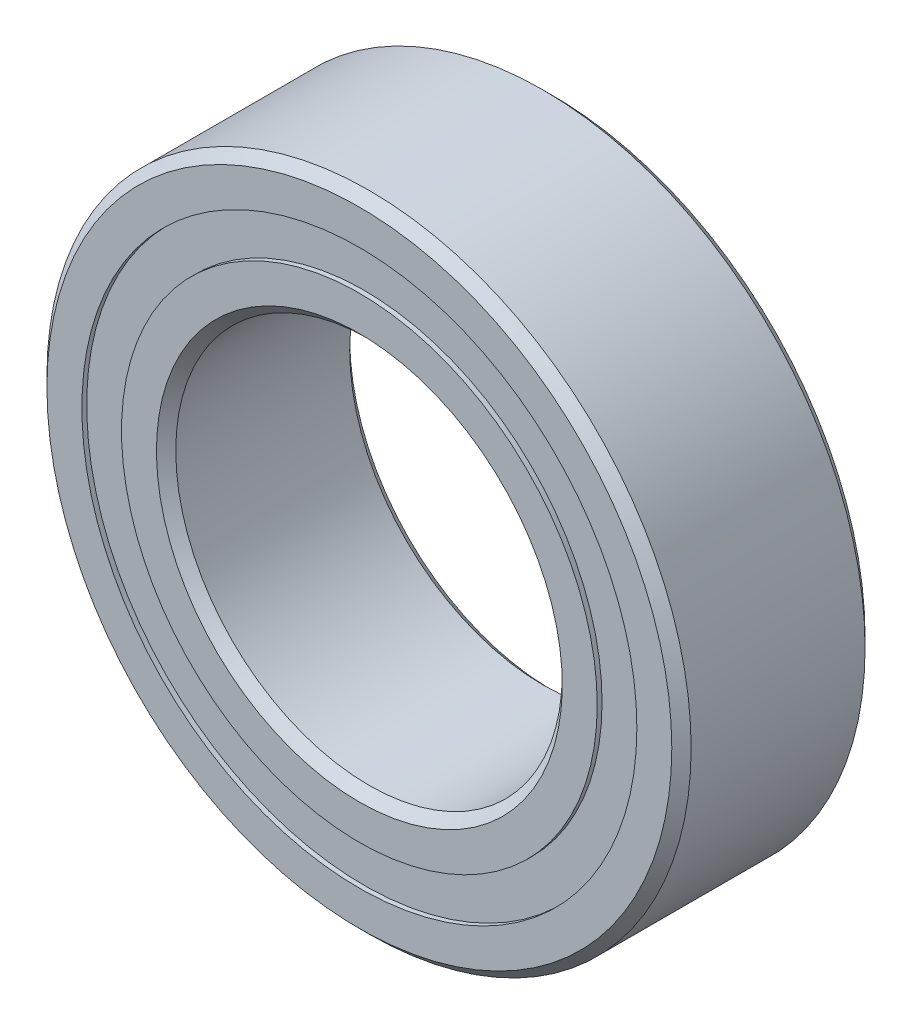
ISO-10303-21;
HEADER;
FILE_DESCRIPTION(('STEP AP214'),'2;1');
FILE_NAME('part.step','',(''),(''),'','','');
FILE_SCHEMA(('AUTOMOTIVE_DESIGN { 1 0 10303 214 1 1 1 1 }'));
ENDSEC;
DATA;
#1=APPLICATION_CONTEXT('core data for automotive mechanical design processes');
#2=APPLICATION_PROTOCOL_DEFINITION('international standard','automotive_design',2000,#1);
#3=PRODUCT_CONTEXT('',#1,'mechanical');
#4=PRODUCT('Part','Part','',(#3));
#5=PRODUCT_RELATED_PRODUCT_CATEGORY('part','',(#4));
#6=PRODUCT_DEFINITION_FORMATION('','',#4);
#7=PRODUCT_DEFINITION_CONTEXT('part definition',#1,'design');
#8=PRODUCT_DEFINITION('design','',#6,#7);
#9=PRODUCT_DEFINITION_SHAPE('','',#8);
#10=(LENGTH_UNIT() NAMED_UNIT(*) SI_UNIT(.MILLI.,.METRE.));
#11=(NAMED_UNIT(*) PLANE_ANGLE_UNIT() SI_UNIT($,.RADIAN.));
#12=(NAMED_UNIT(*) SI_UNIT($,.STERADIAN.) SOLID_ANGLE_UNIT());
#13=UNCERTAINTY_MEASURE_WITH_UNIT(LENGTH_MEASURE(1.E-05),#10,'distance_accuracy_value','');
#14=(GEOMETRIC_REPRESENTATION_CONTEXT(3) GLOBAL_UNCERTAINTY_ASSIGNED_CONTEXT((#13)) GLOBAL_UNIT_ASSIGNED_CONTEXT((#10,
#11,#12)) REPRESENTATION_CONTEXT('',''));
#15=CARTESIAN_POINT('',(0.,0.,0.));
#16=DIRECTION('',(0.,0.,1.));
#17=DIRECTION('',(1.,0.,0.));
#18=AXIS2_PLACEMENT_3D('',#15,#16,#17);
#19=CARTESIAN_POINT('',(3.46410161513775,-2.00000000000002,0.));
#20=DIRECTION('',(0.866025403784436,-0.500000000000004,0.));
#21=DIRECTION('',(0.,0.,-1.));
#22=AXIS2_PLACEMENT_3D('',#19,#20,#21);
#23=SPHERICAL_SURFACE('',#22,0.734247234014171);
#24=CARTESIAN_POINT('',(4.09997837245248,-2.36712361700711,0.));
#25=VERTEX_POINT('',#24);
#26=VERTEX_LOOP('',#25);
#27=FACE_BOUND('',#26,.T.);
#28=CARTESIAN_POINT('',(2.82822485782302,-1.63287638299293,0.));
#29=VERTEX_POINT('',#28);
#30=VERTEX_LOOP('',#29);
#31=FACE_BOUND('',#30,.T.);
#32=ADVANCED_FACE('P0_F15',(#27,#31),#23,.T.);
#33=CLOSED_SHELL('',(#32));
#34=MANIFOLD_SOLID_BREP('P0_B1',#33);
#35=CARTESIAN_POINT('',(0.,4.30769230769231,0.734247234014171));
#36=DIRECTION('',(0.,0.,1.));
#37=DIRECTION('',(1.,0.,0.));
#38=AXIS2_PLACEMENT_3D('',#35,#36,#37);
#39=PLANE('',#38);
#40=CARTESIAN_POINT('',(0.,0.,0.734247234014171));
#41=DIRECTION('',(0.,0.,1.));
#42=DIRECTION('',(1.,0.,0.));
#43=AXIS2_PLACEMENT_3D('',#40,#41,#42);
#44=CIRCLE('',#43,3.69230769230769);
#45=CARTESIAN_POINT('',(3.69230769230769,0.,0.734247234014171));
#46=VERTEX_POINT('',#45);
#47=EDGE_CURVE('P1_E17',#46,#46,#44,.T.);
#48=ORIENTED_EDGE('',*,*,#47,.T.);
#49=EDGE_LOOP('',(#48));
#50=FACE_BOUND('',#49,.T.);
#51=CARTESIAN_POINT('',(0.,0.,0.734247234014171));
#52=DIRECTION('',(0.,0.,1.));
#53=DIRECTION('',(1.,0.,0.));
#54=AXIS2_PLACEMENT_3D('',#51,#52,#53);
#55=CIRCLE('',#54,4.30769230769231);
#56=CARTESIAN_POINT('',(4.30769230769231,0.,0.734247234014171));
#57=VERTEX_POINT('',#56);
#58=EDGE_CURVE('P1_E26',#57,#57,#55,.T.);
#59=ORIENTED_EDGE('',*,*,#58,.F.);
#60=EDGE_LOOP('',(#59));
#61=FACE_BOUND('',#60,.T.);
#62=ADVANCED_FACE('P1_F14',(#50,#61),#39,.F.);
#63=CARTESIAN_POINT('',(0.,0.,1.5));
#64=DIRECTION('',(0.,0.,1.));
#65=DIRECTION('',(1.,0.,0.));
#66=AXIS2_PLACEMENT_3D('',#63,#64,#65);
#67=CYLINDRICAL_SURFACE('',#66,3.69230769230769);
#68=ORIENTED_EDGE('',*,*,#47,.F.);
#69=EDGE_LOOP('',(#68));
#70=FACE_BOUND('',#69,.T.);
#71=CARTESIAN_POINT('',(0.,0.,1.425));
#72=DIRECTION('',(0.,0.,1.));
#73=DIRECTION('',(1.,0.,0.));
#74=AXIS2_PLACEMENT_3D('',#71,#72,#73);
#75=CIRCLE('',#74,3.69230769230769);
#76=CARTESIAN_POINT('',(3.69230769230769,0.,1.425));
#77=VERTEX_POINT('',#76);
#78=EDGE_CURVE('P1_E21',#77,#77,#75,.T.);
#79=ORIENTED_EDGE('',*,*,#78,.T.);
#80=EDGE_LOOP('',(#79));
#81=FACE_BOUND('',#80,.T.);
#82=ADVANCED_FACE('P1_F36',(#70,#81),#67,.F.);
#83=CARTESIAN_POINT('',(0.,0.,1.5));
#84=DIRECTION('',(0.,0.,1.));
#85=DIRECTION('',(1.,0.,0.));
#86=AXIS2_PLACEMENT_3D('',#83,#84,#85);
#87=CYLINDRICAL_SURFACE('',#86,4.30769230769231);
#88=CARTESIAN_POINT('',(0.,0.,1.425));
#89=DIRECTION('',(0.,0.,1.));
#90=DIRECTION('',(1.,0.,0.));
#91=AXIS2_PLACEMENT_3D('',#88,#89,#90);
#92=CIRCLE('',#91,4.30769230769231);
#93=CARTESIAN_POINT('',(4.30769230769231,0.,1.425));
#94=VERTEX_POINT('',#93);
#95=EDGE_CURVE('P1_E10',#94,#94,#92,.F.);
#96=ORIENTED_EDGE('',*,*,#95,.T.);
#97=EDGE_LOOP('',(#96));
#98=FACE_BOUND('',#97,.T.);
#99=ORIENTED_EDGE('',*,*,#58,.T.);
#100=EDGE_LOOP('',(#99));
#101=FACE_BOUND('',#100,.T.);
#102=ADVANCED_FACE('P1_F39',(#98,#101),#87,.T.);
#103=CARTESIAN_POINT('',(0.,4.30769230769231,1.425));
#104=DIRECTION('',(0.,0.,-1.));
#105=DIRECTION('',(-1.,0.,0.));
#106=AXIS2_PLACEMENT_3D('',#103,#104,#105);
#107=PLANE('',#106);
#108=ORIENTED_EDGE('',*,*,#95,.F.);
#109=EDGE_LOOP('',(#108));
#110=FACE_BOUND('',#109,.T.);
#111=ORIENTED_EDGE('',*,*,#78,.F.);
#112=EDGE_LOOP('',(#111));
#113=FACE_BOUND('',#112,.T.);
#114=ADVANCED_FACE('P1_F42',(#110,#113),#107,.F.);
#115=CLOSED_SHELL('',(#62,#82,#102,#114));
#116=MANIFOLD_SOLID_BREP('P1_B1',#115);
#117=CARTESIAN_POINT('',(4.,0.,0.));
#118=DIRECTION('',(1.,0.,0.));
#119=DIRECTION('',(0.,0.,-1.));
#120=AXIS2_PLACEMENT_3D('',#117,#118,#119);
#121=SPHERICAL_SURFACE('',#120,0.734247234014171);
#122=CARTESIAN_POINT('',(3.26575276598583,0.,0.));
#123=VERTEX_POINT('',#122);
#124=VERTEX_LOOP('',#123);
#125=FACE_BOUND('',#124,.T.);
#126=CARTESIAN_POINT('',(4.73424723401417,0.,0.));
#127=VERTEX_POINT('',#126);
#128=VERTEX_LOOP('',#127);
#129=FACE_BOUND('',#128,.T.);
#130=ADVANCED_FACE('P2_F15',(#125,#129),#121,.T.);
#131=CLOSED_SHELL('',(#130));
#132=MANIFOLD_SOLID_BREP('P2_B1',#131);
#133=CARTESIAN_POINT('',(0.,4.,0.));
#134=DIRECTION('',(0.,1.,0.));
#135=DIRECTION('',(0.,0.,-1.));
#136=AXIS2_PLACEMENT_3D('',#133,#134,#135);
#137=SPHERICAL_SURFACE('',#136,0.734247234014171);
#138=CARTESIAN_POINT('',(0.,3.26575276598583,0.));
#139=VERTEX_POINT('',#138);
#140=VERTEX_LOOP('',#139);
#141=FACE_BOUND('',#140,.T.);
#142=CARTESIAN_POINT('',(0.,4.73424723401417,0.));
#143=VERTEX_POINT('',#142);
#144=VERTEX_LOOP('',#143);
#145=FACE_BOUND('',#144,.T.);
#146=ADVANCED_FACE('P3_F15',(#141,#145),#137,.T.);
#147=CLOSED_SHELL('',(#146));
#148=MANIFOLD_SOLID_BREP('P3_B1',#147);
#149=CARTESIAN_POINT('',(0.,4.30769230769231,-1.425));
#150=DIRECTION('',(0.,0.,1.));
#151=DIRECTION('',(1.,0.,0.));
#152=AXIS2_PLACEMENT_3D('',#149,#150,#151);
#153=PLANE('',#152);
#154=CARTESIAN_POINT('',(0.,0.,-1.425));
#155=DIRECTION('',(0.,0.,1.));
#156=DIRECTION('',(1.,0.,0.));
#157=AXIS2_PLACEMENT_3D('',#154,#155,#156);
#158=CIRCLE('',#157,3.69230769230769);
#159=CARTESIAN_POINT('',(3.69230769230769,0.,-1.425));
#160=VERTEX_POINT('',#159);
#161=EDGE_CURVE('P4_E17',#160,#160,#158,.T.);
#162=ORIENTED_EDGE('',*,*,#161,.T.);
#163=EDGE_LOOP('',(#162));
#164=FACE_BOUND('',#163,.T.);
#165=CARTESIAN_POINT('',(0.,0.,-1.425));
#166=DIRECTION('',(0.,0.,1.));
#167=DIRECTION('',(1.,0.,0.));
#168=AXIS2_PLACEMENT_3D('',#165,#166,#167);
#169=CIRCLE('',#168,4.30769230769231);
#170=CARTESIAN_POINT('',(4.30769230769231,0.,-1.425));
#171=VERTEX_POINT('',#170);
#172=EDGE_CURVE('P4_E26',#171,#171,#169,.T.);
#173=ORIENTED_EDGE('',*,*,#172,.F.);
#174=EDGE_LOOP('',(#173));
#175=FACE_BOUND('',#174,.T.);
#176=ADVANCED_FACE('P4_F14',(#164,#175),#153,.F.);
#177=CARTESIAN_POINT('',(0.,0.,1.5));
#178=DIRECTION('',(0.,0.,1.));
#179=DIRECTION('',(1.,0.,0.));
#180=AXIS2_PLACEMENT_3D('',#177,#178,#179);
#181=CYLINDRICAL_SURFACE('',#180,3.69230769230769);
#182=ORIENTED_EDGE('',*,*,#161,.F.);
#183=EDGE_LOOP('',(#182));
#184=FACE_BOUND('',#183,.T.);
#185=CARTESIAN_POINT('',(0.,0.,-0.734247234014172));
#186=DIRECTION('',(0.,0.,1.));
#187=DIRECTION('',(1.,0.,0.));
#188=AXIS2_PLACEMENT_3D('',#185,#186,#187);
#189=CIRCLE('',#188,3.69230769230769);
#190=CARTESIAN_POINT('',(3.69230769230769,0.,-0.734247234014172));
#191=VERTEX_POINT('',#190);
#192=EDGE_CURVE('P4_E21',#191,#191,#189,.T.);
#193=ORIENTED_EDGE('',*,*,#192,.T.);
#194=EDGE_LOOP('',(#193));
#195=FACE_BOUND('',#194,.T.);
#196=ADVANCED_FACE('P4_F36',(#184,#195),#181,.F.);
#197=CARTESIAN_POINT('',(0.,0.,1.5));
#198=DIRECTION('',(0.,0.,1.));
#199=DIRECTION('',(1.,0.,0.));
#200=AXIS2_PLACEMENT_3D('',#197,#198,#199);
#201=CYLINDRICAL_SURFACE('',#200,4.30769230769231);
#202=CARTESIAN_POINT('',(0.,0.,-0.734247234014172));
#203=DIRECTION('',(0.,0.,1.));
#204=DIRECTION('',(1.,0.,0.));
#205=AXIS2_PLACEMENT_3D('',#202,#203,#204);
#206=CIRCLE('',#205,4.30769230769231);
#207=CARTESIAN_POINT('',(4.30769230769231,0.,-0.734247234014172));
#208=VERTEX_POINT('',#207);
#209=EDGE_CURVE('P4_E10',#208,#208,#206,.F.);
#210=ORIENTED_EDGE('',*,*,#209,.T.);
#211=EDGE_LOOP('',(#210));
#212=FACE_BOUND('',#211,.T.);
#213=ORIENTED_EDGE('',*,*,#172,.T.);
#214=EDGE_LOOP('',(#213));
#215=FACE_BOUND('',#214,.T.);
#216=ADVANCED_FACE('P4_F39',(#212,#215),#201,.T.);
#217=CARTESIAN_POINT('',(0.,4.30769230769231,-0.734247234014172));
#218=DIRECTION('',(0.,0.,-1.));
#219=DIRECTION('',(-1.,0.,0.));
#220=AXIS2_PLACEMENT_3D('',#217,#218,#219);
#221=PLANE('',#220);
#222=ORIENTED_EDGE('',*,*,#209,.F.);
#223=EDGE_LOOP('',(#222));
#224=FACE_BOUND('',#223,.T.);
#225=ORIENTED_EDGE('',*,*,#192,.F.);
#226=EDGE_LOOP('',(#225));
#227=FACE_BOUND('',#226,.T.);
#228=ADVANCED_FACE('P4_F42',(#224,#227),#221,.F.);
#229=CLOSED_SHELL('',(#176,#196,#216,#228));
#230=MANIFOLD_SOLID_BREP('P4_B1',#229);
#231=CARTESIAN_POINT('',(0.,0.,0.));
#232=DIRECTION('',(0.,0.,1.));
#233=DIRECTION('',(1.,0.,0.));
#234=AXIS2_PLACEMENT_3D('',#231,#232,#233);
#235=TOROIDAL_SURFACE('',#234,4.,0.73424723401417);
#236=CARTESIAN_POINT('',(0.,0.,0.666666666666667));
#237=DIRECTION('',(0.,0.,1.));
#238=DIRECTION('',(1.,0.,0.));
#239=AXIS2_PLACEMENT_3D('',#236,#237,#238);
#240=CIRCLE('',#239,3.69230769230769);
#241=CARTESIAN_POINT('',(3.69230769230769,0.,0.666666666666667));
#242=VERTEX_POINT('',#241);
#243=EDGE_CURVE('P5_E32',#242,#242,#240,.T.);
#244=ORIENTED_EDGE('',*,*,#243,.F.);
#245=EDGE_LOOP('',(#244));
#246=FACE_BOUND('',#245,.T.);
#247=CARTESIAN_POINT('',(0.,0.,-0.666666666666668));
#248=DIRECTION('',(0.,0.,1.));
#249=DIRECTION('',(1.,0.,0.));
#250=AXIS2_PLACEMENT_3D('',#247,#248,#249);
#251=CIRCLE('',#250,3.69230769230769);
#252=CARTESIAN_POINT('',(3.69230769230769,0.,-0.666666666666668));
#253=VERTEX_POINT('',#252);
#254=EDGE_CURVE('P5_E30',#253,#253,#251,.F.);
#255=ORIENTED_EDGE('',*,*,#254,.F.);
#256=EDGE_LOOP('',(#255));
#257=FACE_BOUND('',#256,.T.);
#258=ADVANCED_FACE('P5_F14',(#246,#257),#235,.F.);
#259=CARTESIAN_POINT('',(0.,0.,1.5));
#260=DIRECTION('',(0.,0.,1.));
#261=DIRECTION('',(1.,0.,0.));
#262=AXIS2_PLACEMENT_3D('',#259,#260,#261);
#263=CYLINDRICAL_SURFACE('',#262,3.69230769230769);
#264=CARTESIAN_POINT('',(0.,0.,1.5));
#265=DIRECTION('',(0.,0.,1.));
#266=DIRECTION('',(1.,0.,0.));
#267=AXIS2_PLACEMENT_3D('',#264,#265,#266);
#268=CIRCLE('',#267,3.69230769230769);
#269=CARTESIAN_POINT('',(3.69230769230769,0.,1.5));
#270=VERTEX_POINT('',#269);
#271=EDGE_CURVE('P5_E18',#270,#270,#268,.F.);
#272=ORIENTED_EDGE('',*,*,#271,.T.);
#273=EDGE_LOOP('',(#272));
#274=FACE_BOUND('',#273,.T.);
#275=ORIENTED_EDGE('',*,*,#243,.T.);
#276=EDGE_LOOP('',(#275));
#277=FACE_BOUND('',#276,.T.);
#278=ADVANCED_FACE('P5_F48',(#274,#277),#263,.T.);
#279=CARTESIAN_POINT('',(0.,0.,1.5));
#280=DIRECTION('',(0.,0.,1.));
#281=DIRECTION('',(1.,0.,0.));
#282=AXIS2_PLACEMENT_3D('',#279,#280,#281);
#283=CYLINDRICAL_SURFACE('',#282,3.69230769230769);
#284=ORIENTED_EDGE('',*,*,#254,.T.);
#285=EDGE_LOOP('',(#284));
#286=FACE_BOUND('',#285,.T.);
#287=CARTESIAN_POINT('',(0.,0.,-1.5));
#288=DIRECTION('',(0.,0.,1.));
#289=DIRECTION('',(1.,0.,0.));
#290=AXIS2_PLACEMENT_3D('',#287,#288,#289);
#291=CIRCLE('',#290,3.69230769230769);
#292=CARTESIAN_POINT('',(3.69230769230769,0.,-1.5));
#293=VERTEX_POINT('',#292);
#294=EDGE_CURVE('P5_E41',#293,#293,#291,.T.);
#295=ORIENTED_EDGE('',*,*,#294,.T.);
#296=EDGE_LOOP('',(#295));
#297=FACE_BOUND('',#296,.T.);
#298=ADVANCED_FACE('P5_F55',(#286,#297),#283,.T.);
#299=CARTESIAN_POINT('',(0.,3.69230769230769,1.5));
#300=DIRECTION('',(0.,0.,-1.));
#301=DIRECTION('',(-1.,0.,0.));
#302=AXIS2_PLACEMENT_3D('',#299,#300,#301);
#303=PLANE('',#302);
#304=ORIENTED_EDGE('',*,*,#271,.F.);
#305=EDGE_LOOP('',(#304));
#306=FACE_BOUND('',#305,.T.);
#307=CARTESIAN_POINT('',(0.,0.,1.50000000002137));
#308=DIRECTION('',(0.,0.,1.));
#309=DIRECTION('',(0.,-1.,0.));
#310=AXIS2_PLACEMENT_3D('',#307,#308,#309);
#311=CIRCLE('',#310,3.15000000000509);
#312=CARTESIAN_POINT('',(0.,-3.15000000000509,1.50000000002137));
#313=VERTEX_POINT('',#312);
#314=EDGE_CURVE('P5_E39',#313,#313,#311,.F.);
#315=ORIENTED_EDGE('',*,*,#314,.T.);
#316=EDGE_LOOP('',(#315));
#317=FACE_BOUND('',#316,.T.);
#318=ADVANCED_FACE('P5_F51',(#306,#317),#303,.F.);
#319=CARTESIAN_POINT('',(0.,3.15,-1.5));
#320=DIRECTION('',(0.,0.,1.));
#321=DIRECTION('',(1.,0.,0.));
#322=AXIS2_PLACEMENT_3D('',#319,#320,#321);
#323=PLANE('',#322);
#324=CARTESIAN_POINT('',(0.,0.,-1.50000000002137));
#325=DIRECTION('',(0.,0.,-1.));
#326=DIRECTION('',(-1.,0.,0.));
#327=AXIS2_PLACEMENT_3D('',#324,#325,#326);
#328=CIRCLE('',#327,3.14999999989141);
#329=CARTESIAN_POINT('',(-3.14999999989141,0.,-1.50000000002137));
#330=VERTEX_POINT('',#329);
#331=EDGE_CURVE('P5_E27',#330,#330,#328,.F.);
#332=ORIENTED_EDGE('',*,*,#331,.T.);
#333=EDGE_LOOP('',(#332));
#334=FACE_BOUND('',#333,.T.);
#335=ORIENTED_EDGE('',*,*,#294,.F.);
#336=EDGE_LOOP('',(#335));
#337=FACE_BOUND('',#336,.T.);
#338=ADVANCED_FACE('P5_F54',(#334,#337),#323,.F.);
#339=CARTESIAN_POINT('',(0.,0.,1.50000000002137));
#340=DIRECTION('',(0.,0.,1.));
#341=DIRECTION('',(0.,-1.,0.));
#342=AXIS2_PLACEMENT_3D('',#339,#340,#341);
#343=CONICAL_SURFACE('',#342,3.15000000000509,0.785398163397448);
#344=ORIENTED_EDGE('',*,*,#314,.F.);
#345=EDGE_LOOP('',(#344));
#346=FACE_BOUND('',#345,.T.);
#347=CARTESIAN_POINT('',(0.,0.,1.35));
#348=DIRECTION('',(0.,0.,1.));
#349=DIRECTION('',(1.,0.,0.));
#350=AXIS2_PLACEMENT_3D('',#347,#348,#349);
#351=CIRCLE('',#350,3.);
#352=CARTESIAN_POINT('',(3.,0.,1.35));
#353=VERTEX_POINT('',#352);
#354=EDGE_CURVE('P5_E22',#353,#353,#351,.F.);
#355=ORIENTED_EDGE('',*,*,#354,.T.);
#356=EDGE_LOOP('',(#355));
#357=FACE_BOUND('',#356,.T.);
#358=ADVANCED_FACE('P5_F59',(#346,#357),#343,.F.);
#359=CARTESIAN_POINT('',(0.,0.,-1.49999999996453));
#360=DIRECTION('',(0.,0.,-1.));
#361=DIRECTION('',(-1.,0.,0.));
#362=AXIS2_PLACEMENT_3D('',#359,#360,#361);
#363=CONICAL_SURFACE('',#362,3.14999999983456,0.78539816320797);
#364=CARTESIAN_POINT('',(0.,0.,-1.35));
#365=DIRECTION('',(0.,0.,1.));
#366=DIRECTION('',(1.,0.,0.));
#367=AXIS2_PLACEMENT_3D('',#364,#365,#366);
#368=CIRCLE('',#367,3.);
#369=CARTESIAN_POINT('',(3.,0.,-1.35));
#370=VERTEX_POINT('',#369);
#371=EDGE_CURVE('P5_E10',#370,#370,#368,.T.);
#372=ORIENTED_EDGE('',*,*,#371,.T.);
#373=EDGE_LOOP('',(#372));
#374=FACE_BOUND('',#373,.T.);
#375=ORIENTED_EDGE('',*,*,#331,.F.);
#376=EDGE_LOOP('',(#375));
#377=FACE_BOUND('',#376,.T.);
#378=ADVANCED_FACE('P5_F62',(#374,#377),#363,.F.);
#379=CARTESIAN_POINT('',(0.,0.,1.5));
#380=DIRECTION('',(0.,0.,1.));
#381=DIRECTION('',(1.,0.,0.));
#382=AXIS2_PLACEMENT_3D('',#379,#380,#381);
#383=CYLINDRICAL_SURFACE('',#382,3.);
#384=ORIENTED_EDGE('',*,*,#354,.F.);
#385=EDGE_LOOP('',(#384));
#386=FACE_BOUND('',#385,.T.);
#387=ORIENTED_EDGE('',*,*,#371,.F.);
#388=EDGE_LOOP('',(#387));
#389=FACE_BOUND('',#388,.T.);
#390=ADVANCED_FACE('P5_F66',(#386,#389),#383,.F.);
#391=CLOSED_SHELL('',(#258,#278,#298,#318,#338,#358,#378,#390));
#392=MANIFOLD_SOLID_BREP('P5_B1',#391);
#393=CARTESIAN_POINT('',(-1.99999999999996,3.46410161513778,0.));
#394=DIRECTION('',(-0.499999999999989,0.866025403784445,0.));
#395=DIRECTION('',(0.,0.,-1.));
#396=AXIS2_PLACEMENT_3D('',#393,#394,#395);
#397=SPHERICAL_SURFACE('',#396,0.734247234014171);
#398=CARTESIAN_POINT('',(-2.36712361700703,4.09997837245252,0.));
#399=VERTEX_POINT('',#398);
#400=VERTEX_LOOP('',#399);
#401=FACE_BOUND('',#400,.T.);
#402=CARTESIAN_POINT('',(-1.63287638299288,2.82822485782305,0.));
#403=VERTEX_POINT('',#402);
#404=VERTEX_LOOP('',#403);
#405=FACE_BOUND('',#404,.T.);
#406=ADVANCED_FACE('P6_F15',(#401,#405),#397,.T.);
#407=CLOSED_SHELL('',(#406));
#408=MANIFOLD_SOLID_BREP('P6_B1',#407);
#409=CARTESIAN_POINT('',(-3.46410161513777,-1.99999999999997,0.));
#410=DIRECTION('',(-0.866025403784443,-0.499999999999992,0.));
#411=DIRECTION('',(0.,0.,-1.));
#412=AXIS2_PLACEMENT_3D('',#409,#410,#411);
#413=SPHERICAL_SURFACE('',#412,0.734247234014171);
#414=CARTESIAN_POINT('',(-4.09997837245251,-2.36712361700705,0.));
#415=VERTEX_POINT('',#414);
#416=VERTEX_LOOP('',#415);
#417=FACE_BOUND('',#416,.T.);
#418=CARTESIAN_POINT('',(-2.82822485782304,-1.63287638299289,0.));
#419=VERTEX_POINT('',#418);
#420=VERTEX_LOOP('',#419);
#421=FACE_BOUND('',#420,.T.);
#422=ADVANCED_FACE('P7_F15',(#417,#421),#413,.T.);
#423=CLOSED_SHELL('',(#422));
#424=MANIFOLD_SOLID_BREP('P7_B1',#423);
#425=CARTESIAN_POINT('',(2.,3.46410161513775,0.));
#426=DIRECTION('',(0.500000000000001,0.866025403784438,0.));
#427=DIRECTION('',(0.,0.,-1.));
#428=AXIS2_PLACEMENT_3D('',#425,#426,#427);
#429=SPHERICAL_SURFACE('',#428,0.734247234014171);
#430=CARTESIAN_POINT('',(2.36712361700709,4.09997837245248,0.));
#431=VERTEX_POINT('',#430);
#432=VERTEX_LOOP('',#431);
#433=FACE_BOUND('',#432,.T.);
#434=CARTESIAN_POINT('',(1.63287638299292,2.82822485782302,0.));
#435=VERTEX_POINT('',#434);
#436=VERTEX_LOOP('',#435);
#437=FACE_BOUND('',#436,.T.);
#438=ADVANCED_FACE('P8_F15',(#433,#437),#429,.T.);
#439=CLOSED_SHELL('',(#438));
#440=MANIFOLD_SOLID_BREP('P8_B1',#439);
#441=CARTESIAN_POINT('',(-4.,0.,0.));
#442=DIRECTION('',(-1.,0.,0.));
#443=DIRECTION('',(0.,0.,-1.));
#444=AXIS2_PLACEMENT_3D('',#441,#442,#443);
#445=SPHERICAL_SURFACE('',#444,0.734247234014171);
#446=CARTESIAN_POINT('',(-4.73424723401417,0.,0.));
#447=VERTEX_POINT('',#446);
#448=VERTEX_LOOP('',#447);
#449=FACE_BOUND('',#448,.T.);
#450=CARTESIAN_POINT('',(-3.26575276598583,0.,0.));
#451=VERTEX_POINT('',#450);
#452=VERTEX_LOOP('',#451);
#453=FACE_BOUND('',#452,.T.);
#454=ADVANCED_FACE('P9_F15',(#449,#453),#445,.T.);
#455=CLOSED_SHELL('',(#454));
#456=MANIFOLD_SOLID_BREP('P9_B1',#455);
#457=CARTESIAN_POINT('',(-2.00000000000003,-3.46410161513774,0.));
#458=DIRECTION('',(-0.500000000000007,-0.866025403784435,0.));
#459=DIRECTION('',(0.,0.,-1.));
#460=AXIS2_PLACEMENT_3D('',#457,#458,#459);
#461=SPHERICAL_SURFACE('',#460,0.734247234014171);
#462=CARTESIAN_POINT('',(-2.36712361700712,-4.09997837245247,0.));
#463=VERTEX_POINT('',#462);
#464=VERTEX_LOOP('',#463);
#465=FACE_BOUND('',#464,.T.);
#466=CARTESIAN_POINT('',(-1.63287638299294,-2.82822485782301,0.));
#467=VERTEX_POINT('',#466);
#468=VERTEX_LOOP('',#467);
#469=FACE_BOUND('',#468,.T.);
#470=ADVANCED_FACE('P10_F15',(#465,#469),#461,.T.);
#471=CLOSED_SHELL('',(#470));
#472=MANIFOLD_SOLID_BREP('P10_B1',#471);
#473=CARTESIAN_POINT('',(0.,-4.,0.));
#474=DIRECTION('',(0.,-1.,0.));
#475=DIRECTION('',(0.,0.,-1.));
#476=AXIS2_PLACEMENT_3D('',#473,#474,#475);
#477=SPHERICAL_SURFACE('',#476,0.734247234014171);
#478=CARTESIAN_POINT('',(0.,-4.73424723401417,0.));
#479=VERTEX_POINT('',#478);
#480=VERTEX_LOOP('',#479);
#481=FACE_BOUND('',#480,.T.);
#482=CARTESIAN_POINT('',(0.,-3.26575276598583,0.));
#483=VERTEX_POINT('',#482);
#484=VERTEX_LOOP('',#483);
#485=FACE_BOUND('',#484,.T.);
#486=ADVANCED_FACE('P11_F15',(#481,#485),#477,.T.);
#487=CLOSED_SHELL('',(#486));
#488=MANIFOLD_SOLID_BREP('P11_B1',#487);
#489=CARTESIAN_POINT('',(3.46410161513776,1.99999999999999,0.));
#490=DIRECTION('',(0.86602540378444,0.499999999999998,0.));
#491=DIRECTION('',(0.,0.,-1.));
#492=AXIS2_PLACEMENT_3D('',#489,#490,#491);
#493=SPHERICAL_SURFACE('',#492,0.734247234014171);
#494=CARTESIAN_POINT('',(4.09997837245249,2.36712361700708,0.));
#495=VERTEX_POINT('',#494);
#496=VERTEX_LOOP('',#495);
#497=FACE_BOUND('',#496,.T.);
#498=CARTESIAN_POINT('',(2.82822485782303,1.63287638299291,0.));
#499=VERTEX_POINT('',#498);
#500=VERTEX_LOOP('',#499);
#501=FACE_BOUND('',#500,.T.);
#502=ADVANCED_FACE('P12_F15',(#497,#501),#493,.T.);
#503=CLOSED_SHELL('',(#502));
#504=MANIFOLD_SOLID_BREP('P12_B1',#503);
#505=CARTESIAN_POINT('',(0.,0.,0.));
#506=DIRECTION('',(0.,0.,1.));
#507=DIRECTION('',(1.,0.,0.));
#508=AXIS2_PLACEMENT_3D('',#505,#506,#507);
#509=TOROIDAL_SURFACE('',#508,4.,0.734247234014171);
#510=CARTESIAN_POINT('',(0.,0.,-0.666666666666667));
#511=DIRECTION('',(0.,0.,1.));
#512=DIRECTION('',(1.,0.,0.));
#513=AXIS2_PLACEMENT_3D('',#510,#511,#512);
#514=CIRCLE('',#513,4.30769230769231);
#515=CARTESIAN_POINT('',(4.30769230769231,0.,-0.666666666666667));
#516=VERTEX_POINT('',#515);
#517=EDGE_CURVE('P13_E32',#516,#516,#514,.F.);
#518=ORIENTED_EDGE('',*,*,#517,.T.);
#519=EDGE_LOOP('',(#518));
#520=FACE_BOUND('',#519,.T.);
#521=CARTESIAN_POINT('',(0.,0.,0.666666666666667));
#522=DIRECTION('',(0.,0.,1.));
#523=DIRECTION('',(1.,0.,0.));
#524=AXIS2_PLACEMENT_3D('',#521,#522,#523);
#525=CIRCLE('',#524,4.30769230769231);
#526=CARTESIAN_POINT('',(4.30769230769231,0.,0.666666666666667));
#527=VERTEX_POINT('',#526);
#528=EDGE_CURVE('P13_E30',#527,#527,#525,.T.);
#529=ORIENTED_EDGE('',*,*,#528,.T.);
#530=EDGE_LOOP('',(#529));
#531=FACE_BOUND('',#530,.T.);
#532=ADVANCED_FACE('P13_F14',(#520,#531),#509,.F.);
#533=CARTESIAN_POINT('',(0.,0.,1.5));
#534=DIRECTION('',(0.,0.,1.));
#535=DIRECTION('',(1.,0.,0.));
#536=AXIS2_PLACEMENT_3D('',#533,#534,#535);
#537=CYLINDRICAL_SURFACE('',#536,4.30769230769231);
#538=CARTESIAN_POINT('',(0.,0.,-1.5));
#539=DIRECTION('',(0.,0.,1.));
#540=DIRECTION('',(1.,0.,0.));
#541=AXIS2_PLACEMENT_3D('',#538,#539,#540);
#542=CIRCLE('',#541,4.30769230769231);
#543=CARTESIAN_POINT('',(4.30769230769231,0.,-1.5));
#544=VERTEX_POINT('',#543);
#545=EDGE_CURVE('P13_E18',#544,#544,#542,.F.);
#546=ORIENTED_EDGE('',*,*,#545,.T.);
#547=EDGE_LOOP('',(#546));
#548=FACE_BOUND('',#547,.T.);
#549=ORIENTED_EDGE('',*,*,#517,.F.);
#550=EDGE_LOOP('',(#549));
#551=FACE_BOUND('',#550,.T.);
#552=ADVANCED_FACE('P13_F48',(#548,#551),#537,.F.);
#553=CARTESIAN_POINT('',(0.,0.,1.5));
#554=DIRECTION('',(0.,0.,1.));
#555=DIRECTION('',(1.,0.,0.));
#556=AXIS2_PLACEMENT_3D('',#553,#554,#555);
#557=CYLINDRICAL_SURFACE('',#556,4.30769230769231);
#558=ORIENTED_EDGE('',*,*,#528,.F.);
#559=EDGE_LOOP('',(#558));
#560=FACE_BOUND('',#559,.T.);
#561=CARTESIAN_POINT('',(0.,0.,1.5));
#562=DIRECTION('',(0.,0.,1.));
#563=DIRECTION('',(1.,0.,0.));
#564=AXIS2_PLACEMENT_3D('',#561,#562,#563);
#565=CIRCLE('',#564,4.30769230769231);
#566=CARTESIAN_POINT('',(4.30769230769231,0.,1.5));
#567=VERTEX_POINT('',#566);
#568=EDGE_CURVE('P13_E41',#567,#567,#565,.T.);
#569=ORIENTED_EDGE('',*,*,#568,.T.);
#570=EDGE_LOOP('',(#569));
#571=FACE_BOUND('',#570,.T.);
#572=ADVANCED_FACE('P13_F55',(#560,#571),#557,.F.);
#573=CARTESIAN_POINT('',(0.,4.85,-1.5));
#574=DIRECTION('',(0.,0.,1.));
#575=DIRECTION('',(1.,0.,0.));
#576=AXIS2_PLACEMENT_3D('',#573,#574,#575);
#577=PLANE('',#576);
#578=ORIENTED_EDGE('',*,*,#545,.F.);
#579=EDGE_LOOP('',(#578));
#580=FACE_BOUND('',#579,.T.);
#581=CARTESIAN_POINT('',(0.,0.,-1.50000000002137));
#582=DIRECTION('',(0.,0.,1.));
#583=DIRECTION('',(1.,0.,0.));
#584=AXIS2_PLACEMENT_3D('',#581,#582,#583);
#585=CIRCLE('',#584,4.84999999997626);
#586=CARTESIAN_POINT('',(4.84999999997626,0.,-1.50000000002137));
#587=VERTEX_POINT('',#586);
#588=EDGE_CURVE('P13_E39',#587,#587,#585,.T.);
#589=ORIENTED_EDGE('',*,*,#588,.F.);
#590=EDGE_LOOP('',(#589));
#591=FACE_BOUND('',#590,.T.);
#592=ADVANCED_FACE('P13_F51',(#580,#591),#577,.F.);
#593=CARTESIAN_POINT('',(0.,4.85,1.5));
#594=DIRECTION('',(0.,0.,-1.));
#595=DIRECTION('',(-1.,0.,0.));
#596=AXIS2_PLACEMENT_3D('',#593,#594,#595);
#597=PLANE('',#596);
#598=CARTESIAN_POINT('',(0.,0.,1.50000000002137));
#599=DIRECTION('',(0.,0.,-1.));
#600=DIRECTION('',(-1.,0.,0.));
#601=AXIS2_PLACEMENT_3D('',#598,#599,#600);
#602=CIRCLE('',#601,4.84999999997626);
#603=CARTESIAN_POINT('',(-4.84999999997626,0.,1.50000000002137));
#604=VERTEX_POINT('',#603);
#605=EDGE_CURVE('P13_E27',#604,#604,#602,.T.);
#606=ORIENTED_EDGE('',*,*,#605,.F.);
#607=EDGE_LOOP('',(#606));
#608=FACE_BOUND('',#607,.T.);
#609=ORIENTED_EDGE('',*,*,#568,.F.);
#610=EDGE_LOOP('',(#609));
#611=FACE_BOUND('',#610,.T.);
#612=ADVANCED_FACE('P13_F54',(#608,#611),#597,.F.);
#613=CARTESIAN_POINT('',(0.,0.,-1.35000000000218));
#614=DIRECTION('',(0.,0.,1.));
#615=DIRECTION('',(1.,0.,0.));
#616=AXIS2_PLACEMENT_3D('',#613,#614,#615);
#617=CONICAL_SURFACE('',#616,4.99999999999545,0.785398163397448);
#618=CARTESIAN_POINT('',(0.,0.,-1.35));
#619=DIRECTION('',(0.,0.,1.));
#620=DIRECTION('',(1.,0.,0.));
#621=AXIS2_PLACEMENT_3D('',#618,#619,#620);
#622=CIRCLE('',#621,5.);
#623=CARTESIAN_POINT('',(5.,0.,-1.35));
#624=VERTEX_POINT('',#623);
#625=EDGE_CURVE('P13_E22',#624,#624,#622,.T.);
#626=ORIENTED_EDGE('',*,*,#625,.F.);
#627=EDGE_LOOP('',(#626));
#628=FACE_BOUND('',#627,.T.);
#629=ORIENTED_EDGE('',*,*,#588,.T.);
#630=EDGE_LOOP('',(#629));
#631=FACE_BOUND('',#630,.T.);
#632=ADVANCED_FACE('P13_F59',(#628,#631),#617,.T.);
#633=CARTESIAN_POINT('',(0.,0.,1.35000000011587));
#634=DIRECTION('',(0.,0.,-1.));
#635=DIRECTION('',(-1.,0.,0.));
#636=AXIS2_PLACEMENT_3D('',#633,#634,#635);
#637=CONICAL_SURFACE('',#636,4.99999999988177,0.785398163397448);
#638=CARTESIAN_POINT('',(0.,0.,1.35));
#639=DIRECTION('',(0.,0.,1.));
#640=DIRECTION('',(1.,0.,0.));
#641=AXIS2_PLACEMENT_3D('',#638,#639,#640);
#642=CIRCLE('',#641,5.);
#643=CARTESIAN_POINT('',(5.,0.,1.35));
#644=VERTEX_POINT('',#643);
#645=EDGE_CURVE('P13_E10',#644,#644,#642,.F.);
#646=ORIENTED_EDGE('',*,*,#645,.F.);
#647=EDGE_LOOP('',(#646));
#648=FACE_BOUND('',#647,.T.);
#649=ORIENTED_EDGE('',*,*,#605,.T.);
#650=EDGE_LOOP('',(#649));
#651=FACE_BOUND('',#650,.T.);
#652=ADVANCED_FACE('P13_F61',(#648,#651),#637,.T.);
#653=CARTESIAN_POINT('',(0.,0.,1.5));
#654=DIRECTION('',(0.,0.,1.));
#655=DIRECTION('',(1.,0.,0.));
#656=AXIS2_PLACEMENT_3D('',#653,#654,#655);
#657=CYLINDRICAL_SURFACE('',#656,5.);
#658=ORIENTED_EDGE('',*,*,#645,.T.);
#659=EDGE_LOOP('',(#658));
#660=FACE_BOUND('',#659,.T.);
#661=ORIENTED_EDGE('',*,*,#625,.T.);
#662=EDGE_LOOP('',(#661));
#663=FACE_BOUND('',#662,.T.);
#664=ADVANCED_FACE('P13_F69',(#660,#663),#657,.T.);
#665=CLOSED_SHELL('',(#532,#552,#572,#592,#612,#632,#652,#664));
#666=MANIFOLD_SOLID_BREP('P13_B1',#665);
#667=CARTESIAN_POINT('',(1.99999999999998,-3.46410161513777,0.));
#668=DIRECTION('',(0.499999999999995,-0.866025403784441,0.));
#669=DIRECTION('',(0.,0.,-1.));
#670=AXIS2_PLACEMENT_3D('',#667,#668,#669);
#671=SPHERICAL_SURFACE('',#670,0.734247234014171);
#672=CARTESIAN_POINT('',(2.36712361700706,-4.0999783724525,0.));
#673=VERTEX_POINT('',#672);
#674=VERTEX_LOOP('',#673);
#675=FACE_BOUND('',#674,.T.);
#676=CARTESIAN_POINT('',(1.6328763829929,-2.82822485782303,0.));
#677=VERTEX_POINT('',#676);
#678=VERTEX_LOOP('',#677);
#679=FACE_BOUND('',#678,.T.);
#680=ADVANCED_FACE('P14_F15',(#675,#679),#671,.T.);
#681=CLOSED_SHELL('',(#680));
#682=MANIFOLD_SOLID_BREP('P14_B1',#681);
#683=CARTESIAN_POINT('',(-3.46410161513773,2.00000000000004,0.));
#684=DIRECTION('',(-0.866025403784433,0.50000000000001,0.));
#685=DIRECTION('',(0.,0.,-1.));
#686=AXIS2_PLACEMENT_3D('',#683,#684,#685);
#687=SPHERICAL_SURFACE('',#686,0.734247234014171);
#688=CARTESIAN_POINT('',(-4.09997837245246,2.36712361700713,0.));
#689=VERTEX_POINT('',#688);
#690=VERTEX_LOOP('',#689);
#691=FACE_BOUND('',#690,.T.);
#692=CARTESIAN_POINT('',(-2.82822485782301,1.63287638299295,0.));
#693=VERTEX_POINT('',#692);
#694=VERTEX_LOOP('',#693);
#695=FACE_BOUND('',#694,.T.);
#696=ADVANCED_FACE('P15_F15',(#691,#695),#687,.T.);
#697=CLOSED_SHELL('',(#696));
#698=MANIFOLD_SOLID_BREP('P15_B1',#697);
#699=ADVANCED_BREP_SHAPE_REPRESENTATION('',(#18,#34,#116,#132,#148,#230,#392,#408,#424,#440,
#456,#472,#488,#504,#666,#682,#698),#14);
#700=SHAPE_DEFINITION_REPRESENTATION(#9,#699);
ENDSEC;
END-ISO-10303-21;
